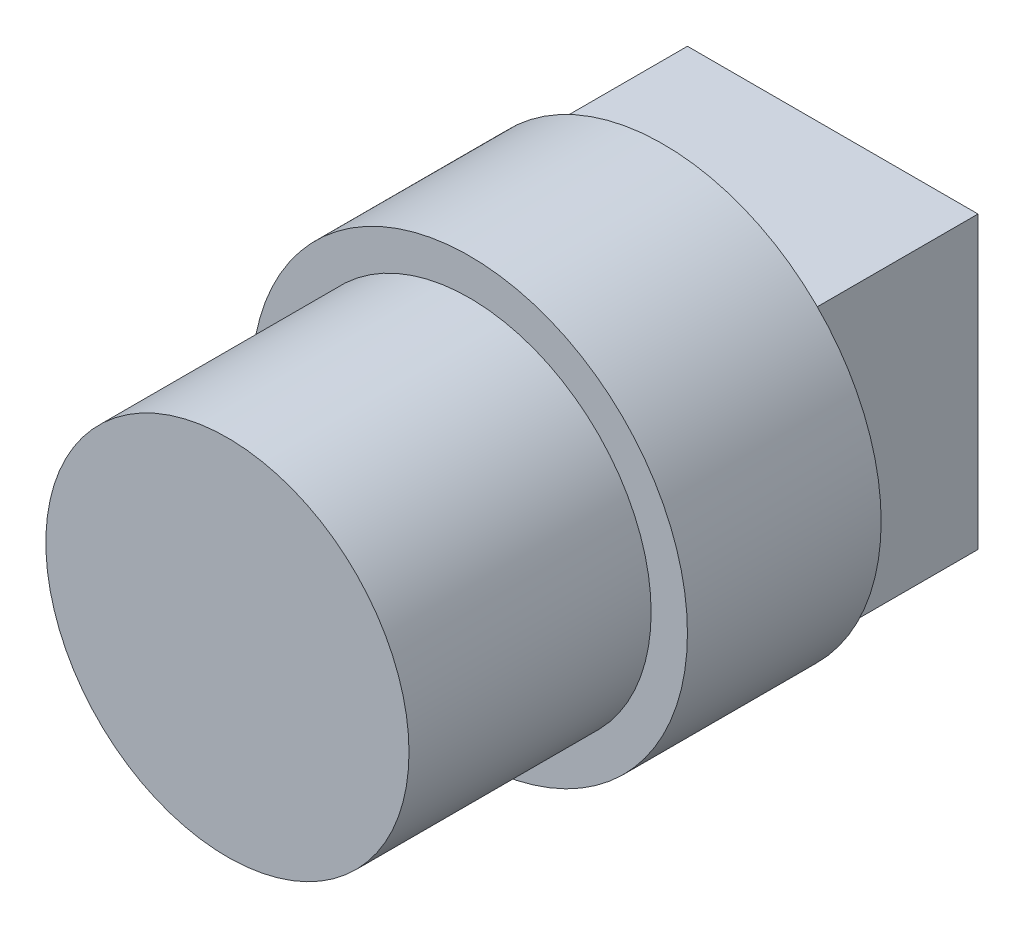
ISO-10303-21;
HEADER;
FILE_DESCRIPTION(('STEP AP214'),'2;1');
FILE_NAME('part.step','',(''),(''),'','','');
FILE_SCHEMA(('AUTOMOTIVE_DESIGN { 1 0 10303 214 1 1 1 1 }'));
ENDSEC;
DATA;
#1=APPLICATION_CONTEXT('core data for automotive mechanical design processes');
#2=APPLICATION_PROTOCOL_DEFINITION('international standard','automotive_design',2000,#1);
#3=PRODUCT_CONTEXT('',#1,'mechanical');
#4=PRODUCT('Part','Part','',(#3));
#5=PRODUCT_RELATED_PRODUCT_CATEGORY('part','',(#4));
#6=PRODUCT_DEFINITION_FORMATION('','',#4);
#7=PRODUCT_DEFINITION_CONTEXT('part definition',#1,'design');
#8=PRODUCT_DEFINITION('design','',#6,#7);
#9=PRODUCT_DEFINITION_SHAPE('','',#8);
#10=(LENGTH_UNIT() NAMED_UNIT(*) SI_UNIT(.MILLI.,.METRE.));
#11=(NAMED_UNIT(*) PLANE_ANGLE_UNIT() SI_UNIT($,.RADIAN.));
#12=(NAMED_UNIT(*) SI_UNIT($,.STERADIAN.) SOLID_ANGLE_UNIT());
#13=UNCERTAINTY_MEASURE_WITH_UNIT(LENGTH_MEASURE(1.E-05),#10,'distance_accuracy_value','');
#14=(GEOMETRIC_REPRESENTATION_CONTEXT(3) GLOBAL_UNCERTAINTY_ASSIGNED_CONTEXT((#13)) GLOBAL_UNIT_ASSIGNED_CONTEXT((#10,
#11,#12)) REPRESENTATION_CONTEXT('',''));
#15=CARTESIAN_POINT('',(0.,0.,0.));
#16=DIRECTION('',(0.,0.,1.));
#17=DIRECTION('',(1.,0.,0.));
#18=AXIS2_PLACEMENT_3D('',#15,#16,#17);
#19=CARTESIAN_POINT('',(3.,-3.,3.5));
#20=DIRECTION('',(-1.,0.,0.));
#21=DIRECTION('',(0.,0.,1.));
#22=AXIS2_PLACEMENT_3D('',#19,#20,#21);
#23=PLANE('',#22);
#24=DIRECTION('',(0.,1.,0.));
#25=VECTOR('',#24,1.);
#26=CARTESIAN_POINT('',(3.,-3.,0.));
#27=LINE('',#26,#25);
#28=CARTESIAN_POINT('',(3.,-3.,0.));
#29=VERTEX_POINT('',#28);
#30=CARTESIAN_POINT('',(3.,3.,0.));
#31=VERTEX_POINT('',#30);
#32=EDGE_CURVE('E103',#29,#31,#27,.T.);
#33=ORIENTED_EDGE('',*,*,#32,.T.);
#34=DIRECTION('',(0.,0.,-1.));
#35=VECTOR('',#34,1.);
#36=CARTESIAN_POINT('',(3.,3.,3.5));
#37=LINE('',#36,#35);
#38=CARTESIAN_POINT('',(3.,3.,3.5));
#39=VERTEX_POINT('',#38);
#40=EDGE_CURVE('E39',#39,#31,#37,.T.);
#41=ORIENTED_EDGE('',*,*,#40,.F.);
#42=DIRECTION('',(0.,1.,0.));
#43=VECTOR('',#42,1.);
#44=CARTESIAN_POINT('',(3.,-3.,3.5));
#45=LINE('',#44,#43);
#46=CARTESIAN_POINT('',(3.,-3.,3.5));
#47=VERTEX_POINT('',#46);
#48=EDGE_CURVE('E86',#47,#39,#45,.T.);
#49=ORIENTED_EDGE('',*,*,#48,.F.);
#50=DIRECTION('',(0.,0.,-1.));
#51=VECTOR('',#50,1.);
#52=CARTESIAN_POINT('',(3.,-3.,3.5));
#53=LINE('',#52,#51);
#54=EDGE_CURVE('E88',#47,#29,#53,.T.);
#55=ORIENTED_EDGE('',*,*,#54,.T.);
#56=EDGE_LOOP('',(#33,#41,#49,#55));
#57=FACE_BOUND('',#56,.T.);
#58=ADVANCED_FACE('F36',(#57),#23,.F.);
#59=CARTESIAN_POINT('',(-3.,3.,3.5));
#60=DIRECTION('',(0.,-1.,0.));
#61=DIRECTION('',(0.,0.,-1.));
#62=AXIS2_PLACEMENT_3D('',#59,#60,#61);
#63=PLANE('',#62);
#64=DIRECTION('',(-1.,0.,0.));
#65=VECTOR('',#64,1.);
#66=CARTESIAN_POINT('',(-3.,3.,0.));
#67=LINE('',#66,#65);
#68=CARTESIAN_POINT('',(-3.,3.,0.));
#69=VERTEX_POINT('',#68);
#70=EDGE_CURVE('E105',#31,#69,#67,.T.);
#71=ORIENTED_EDGE('',*,*,#70,.T.);
#72=DIRECTION('',(0.,0.,-1.));
#73=VECTOR('',#72,1.);
#74=CARTESIAN_POINT('',(-3.,3.,3.5));
#75=LINE('',#74,#73);
#76=CARTESIAN_POINT('',(-3.,3.,3.5));
#77=VERTEX_POINT('',#76);
#78=EDGE_CURVE('E110',#77,#69,#75,.T.);
#79=ORIENTED_EDGE('',*,*,#78,.F.);
#80=DIRECTION('',(-1.,0.,0.));
#81=VECTOR('',#80,1.);
#82=CARTESIAN_POINT('',(-3.,3.,3.5));
#83=LINE('',#82,#81);
#84=EDGE_CURVE('E80',#39,#77,#83,.T.);
#85=ORIENTED_EDGE('',*,*,#84,.F.);
#86=ORIENTED_EDGE('',*,*,#40,.T.);
#87=EDGE_LOOP('',(#71,#79,#85,#86));
#88=FACE_BOUND('',#87,.T.);
#89=ADVANCED_FACE('F111',(#88),#63,.F.);
#90=CARTESIAN_POINT('',(-3.,-3.,3.5));
#91=DIRECTION('',(1.,0.,0.));
#92=DIRECTION('',(0.,0.,-1.));
#93=AXIS2_PLACEMENT_3D('',#90,#91,#92);
#94=PLANE('',#93);
#95=DIRECTION('',(0.,-1.,0.));
#96=VECTOR('',#95,1.);
#97=CARTESIAN_POINT('',(-3.,-3.,0.));
#98=LINE('',#97,#96);
#99=CARTESIAN_POINT('',(-3.,-3.,0.));
#100=VERTEX_POINT('',#99);
#101=EDGE_CURVE('E69',#69,#100,#98,.T.);
#102=ORIENTED_EDGE('',*,*,#101,.T.);
#103=DIRECTION('',(0.,0.,-1.));
#104=VECTOR('',#103,1.);
#105=CARTESIAN_POINT('',(-3.,-3.,3.5));
#106=LINE('',#105,#104);
#107=CARTESIAN_POINT('',(-3.,-3.,3.5));
#108=VERTEX_POINT('',#107);
#109=EDGE_CURVE('E53',#108,#100,#106,.T.);
#110=ORIENTED_EDGE('',*,*,#109,.F.);
#111=DIRECTION('',(0.,-1.,0.));
#112=VECTOR('',#111,1.);
#113=CARTESIAN_POINT('',(-3.,-3.,3.5));
#114=LINE('',#113,#112);
#115=EDGE_CURVE('E98',#77,#108,#114,.T.);
#116=ORIENTED_EDGE('',*,*,#115,.F.);
#117=ORIENTED_EDGE('',*,*,#78,.T.);
#118=EDGE_LOOP('',(#102,#110,#116,#117));
#119=FACE_BOUND('',#118,.T.);
#120=ADVANCED_FACE('F123',(#119),#94,.F.);
#121=CARTESIAN_POINT('',(-3.,-3.,3.5));
#122=DIRECTION('',(0.,1.,0.));
#123=DIRECTION('',(0.,0.,1.));
#124=AXIS2_PLACEMENT_3D('',#121,#122,#123);
#125=PLANE('',#124);
#126=DIRECTION('',(1.,0.,0.));
#127=VECTOR('',#126,1.);
#128=CARTESIAN_POINT('',(-3.,-3.,0.));
#129=LINE('',#128,#127);
#130=EDGE_CURVE('E74',#100,#29,#129,.T.);
#131=ORIENTED_EDGE('',*,*,#130,.T.);
#132=ORIENTED_EDGE('',*,*,#54,.F.);
#133=DIRECTION('',(1.,0.,0.));
#134=VECTOR('',#133,1.);
#135=CARTESIAN_POINT('',(-3.,-3.,3.5));
#136=LINE('',#135,#134);
#137=EDGE_CURVE('E94',#108,#47,#136,.T.);
#138=ORIENTED_EDGE('',*,*,#137,.F.);
#139=ORIENTED_EDGE('',*,*,#109,.T.);
#140=EDGE_LOOP('',(#131,#132,#138,#139));
#141=FACE_BOUND('',#140,.T.);
#142=ADVANCED_FACE('F93',(#141),#125,.F.);
#143=CARTESIAN_POINT('',(0.,0.,0.));
#144=DIRECTION('',(0.,0.,-1.));
#145=DIRECTION('',(-1.,0.,0.));
#146=AXIS2_PLACEMENT_3D('',#143,#144,#145);
#147=PLANE('',#146);
#148=ORIENTED_EDGE('',*,*,#32,.F.);
#149=ORIENTED_EDGE('',*,*,#130,.F.);
#150=ORIENTED_EDGE('',*,*,#101,.F.);
#151=ORIENTED_EDGE('',*,*,#70,.F.);
#152=EDGE_LOOP('',(#148,#149,#150,#151));
#153=FACE_BOUND('',#152,.T.);
#154=ADVANCED_FACE('F113',(#153),#147,.T.);
#155=CARTESIAN_POINT('',(0.,0.,3.5));
#156=DIRECTION('',(0.,0.,1.));
#157=DIRECTION('',(1.,0.,0.));
#158=AXIS2_PLACEMENT_3D('',#155,#156,#157);
#159=PLANE('',#158);
#160=CARTESIAN_POINT('',(0.,0.,3.5));
#161=DIRECTION('',(0.,0.,1.));
#162=DIRECTION('',(1.,0.,0.));
#163=AXIS2_PLACEMENT_3D('',#160,#161,#162);
#164=CIRCLE('',#163,4.5);
#165=CARTESIAN_POINT('',(4.5,0.,3.5));
#166=VERTEX_POINT('',#165);
#167=EDGE_CURVE('E225',#166,#166,#164,.T.);
#168=ORIENTED_EDGE('',*,*,#167,.F.);
#169=EDGE_LOOP('',(#168));
#170=FACE_BOUND('',#169,.T.);
#171=ORIENTED_EDGE('',*,*,#137,.T.);
#172=ORIENTED_EDGE('',*,*,#48,.T.);
#173=ORIENTED_EDGE('',*,*,#84,.T.);
#174=ORIENTED_EDGE('',*,*,#115,.T.);
#175=EDGE_LOOP('',(#171,#172,#173,#174));
#176=FACE_BOUND('',#175,.T.);
#177=ADVANCED_FACE('F97',(#170,#176),#159,.F.);
#178=CARTESIAN_POINT('',(0.,0.,7.5));
#179=DIRECTION('',(0.,0.,-1.));
#180=DIRECTION('',(-1.,0.,0.));
#181=AXIS2_PLACEMENT_3D('',#178,#179,#180);
#182=CYLINDRICAL_SURFACE('',#181,4.5);
#183=CARTESIAN_POINT('',(0.,0.,7.5));
#184=DIRECTION('',(0.,0.,1.));
#185=DIRECTION('',(1.,0.,0.));
#186=AXIS2_PLACEMENT_3D('',#183,#184,#185);
#187=CIRCLE('',#186,4.5);
#188=CARTESIAN_POINT('',(4.5,0.,7.5));
#189=VERTEX_POINT('',#188);
#190=EDGE_CURVE('E106',#189,#189,#187,.T.);
#191=ORIENTED_EDGE('',*,*,#190,.F.);
#192=EDGE_LOOP('',(#191));
#193=FACE_BOUND('',#192,.T.);
#194=ORIENTED_EDGE('',*,*,#167,.T.);
#195=EDGE_LOOP('',(#194));
#196=FACE_BOUND('',#195,.T.);
#197=ADVANCED_FACE('F120',(#193,#196),#182,.T.);
#198=CARTESIAN_POINT('',(0.,0.,7.5));
#199=DIRECTION('',(0.,0.,1.));
#200=DIRECTION('',(1.,0.,0.));
#201=AXIS2_PLACEMENT_3D('',#198,#199,#200);
#202=PLANE('',#201);
#203=CARTESIAN_POINT('',(0.,0.,7.5));
#204=DIRECTION('',(0.,0.,1.));
#205=DIRECTION('',(1.,0.,0.));
#206=AXIS2_PLACEMENT_3D('',#203,#204,#205);
#207=CIRCLE('',#206,3.75);
#208=CARTESIAN_POINT('',(3.75,0.,7.5));
#209=VERTEX_POINT('',#208);
#210=EDGE_CURVE('E11',#209,#209,#207,.T.);
#211=ORIENTED_EDGE('',*,*,#210,.F.);
#212=EDGE_LOOP('',(#211));
#213=FACE_BOUND('',#212,.T.);
#214=ORIENTED_EDGE('',*,*,#190,.T.);
#215=EDGE_LOOP('',(#214));
#216=FACE_BOUND('',#215,.T.);
#217=ADVANCED_FACE('F158',(#213,#216),#202,.T.);
#218=CARTESIAN_POINT('',(0.,0.,12.5));
#219=DIRECTION('',(0.,0.,-1.));
#220=DIRECTION('',(-1.,0.,0.));
#221=AXIS2_PLACEMENT_3D('',#218,#219,#220);
#222=CYLINDRICAL_SURFACE('',#221,3.75);
#223=CARTESIAN_POINT('',(0.,0.,12.5));
#224=DIRECTION('',(0.,0.,1.));
#225=DIRECTION('',(1.,0.,0.));
#226=AXIS2_PLACEMENT_3D('',#223,#224,#225);
#227=CIRCLE('',#226,3.75);
#228=CARTESIAN_POINT('',(3.75,0.,12.5));
#229=VERTEX_POINT('',#228);
#230=EDGE_CURVE('E224',#229,#229,#227,.T.);
#231=ORIENTED_EDGE('',*,*,#230,.F.);
#232=EDGE_LOOP('',(#231));
#233=FACE_BOUND('',#232,.T.);
#234=ORIENTED_EDGE('',*,*,#210,.T.);
#235=EDGE_LOOP('',(#234));
#236=FACE_BOUND('',#235,.T.);
#237=ADVANCED_FACE('F168',(#233,#236),#222,.T.);
#238=CARTESIAN_POINT('',(0.,0.,12.5));
#239=DIRECTION('',(0.,0.,1.));
#240=DIRECTION('',(1.,0.,0.));
#241=AXIS2_PLACEMENT_3D('',#238,#239,#240);
#242=PLANE('',#241);
#243=ORIENTED_EDGE('',*,*,#230,.T.);
#244=EDGE_LOOP('',(#243));
#245=FACE_BOUND('',#244,.T.);
#246=ADVANCED_FACE('F179',(#245),#242,.T.);
#247=CLOSED_SHELL('',(#58,#89,#120,#142,#154,#177,#197,#217,#237,#246));
#248=MANIFOLD_SOLID_BREP('B2',#247);
#249=ADVANCED_BREP_SHAPE_REPRESENTATION('',(#18,#248),#14);
#250=SHAPE_DEFINITION_REPRESENTATION(#9,#249);
ENDSEC;
END-ISO-10303-21;
